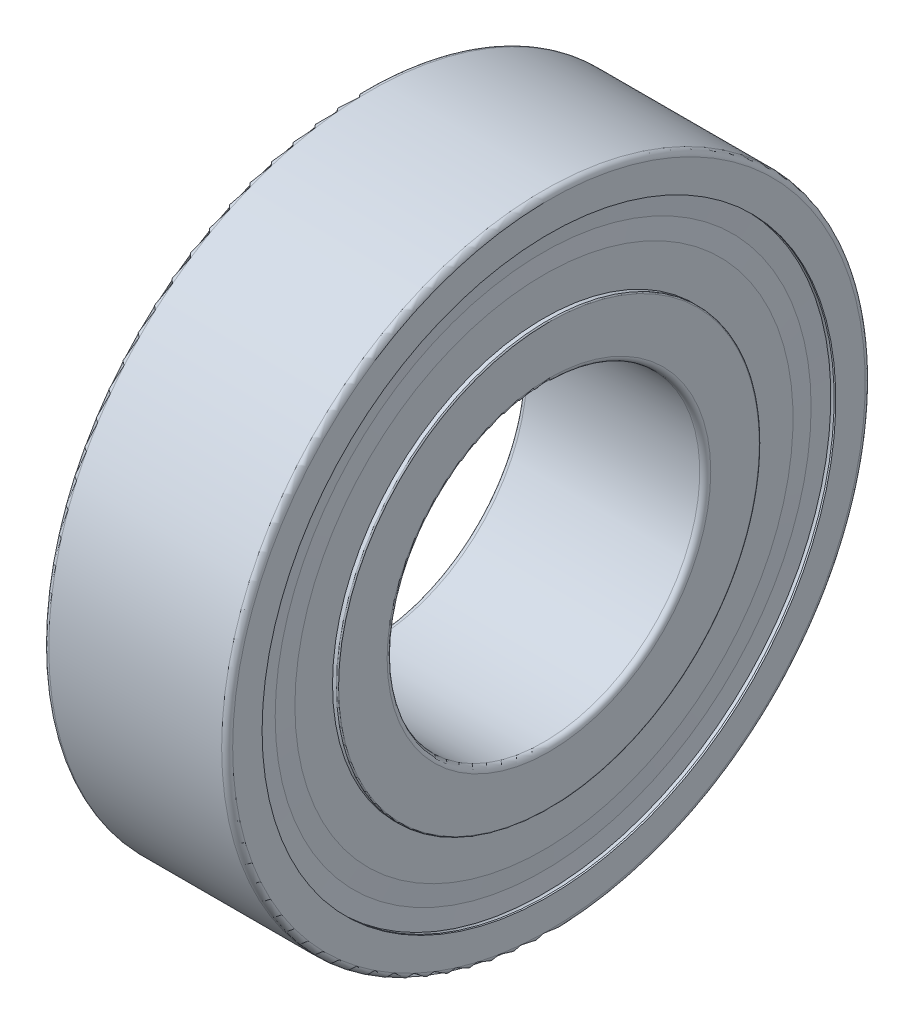
ISO-10303-21;
HEADER;
FILE_DESCRIPTION(('STEP AP214'),'2;1');
FILE_NAME('part.step','',(''),(''),'','','');
FILE_SCHEMA(('AUTOMOTIVE_DESIGN { 1 0 10303 214 1 1 1 1 }'));
ENDSEC;
DATA;
#1=APPLICATION_CONTEXT('core data for automotive mechanical design processes');
#2=APPLICATION_PROTOCOL_DEFINITION('international standard','automotive_design',2000,#1);
#3=PRODUCT_CONTEXT('',#1,'mechanical');
#4=PRODUCT('Part','Part','',(#3));
#5=PRODUCT_RELATED_PRODUCT_CATEGORY('part','',(#4));
#6=PRODUCT_DEFINITION_FORMATION('','',#4);
#7=PRODUCT_DEFINITION_CONTEXT('part definition',#1,'design');
#8=PRODUCT_DEFINITION('design','',#6,#7);
#9=PRODUCT_DEFINITION_SHAPE('','',#8);
#10=(LENGTH_UNIT() NAMED_UNIT(*) SI_UNIT(.MILLI.,.METRE.));
#11=(NAMED_UNIT(*) PLANE_ANGLE_UNIT() SI_UNIT($,.RADIAN.));
#12=(NAMED_UNIT(*) SI_UNIT($,.STERADIAN.) SOLID_ANGLE_UNIT());
#13=UNCERTAINTY_MEASURE_WITH_UNIT(LENGTH_MEASURE(1.E-05),#10,'distance_accuracy_value','');
#14=(GEOMETRIC_REPRESENTATION_CONTEXT(3) GLOBAL_UNCERTAINTY_ASSIGNED_CONTEXT((#13)) GLOBAL_UNIT_ASSIGNED_CONTEXT((#10,
#11,#12)) REPRESENTATION_CONTEXT('',''));
#15=CARTESIAN_POINT('',(0.,0.,0.));
#16=DIRECTION('',(0.,0.,1.));
#17=DIRECTION('',(1.,0.,0.));
#18=AXIS2_PLACEMENT_3D('',#15,#16,#17);
#19=CARTESIAN_POINT('',(50.,0.,0.));
#20=DIRECTION('',(1.,0.,0.));
#21=DIRECTION('',(0.,0.,1.));
#22=AXIS2_PLACEMENT_3D('',#19,#20,#21);
#23=CYLINDRICAL_SURFACE('',#22,15.6);
#24=CARTESIAN_POINT('',(9.73,0.,0.));
#25=DIRECTION('',(-1.,0.,0.));
#26=DIRECTION('',(0.,0.,1.));
#27=AXIS2_PLACEMENT_3D('',#24,#25,#26);
#28=CIRCLE('',#27,15.6);
#29=CARTESIAN_POINT('',(9.73,0.,15.6));
#30=VERTEX_POINT('',#29);
#31=EDGE_CURVE('E12',#30,#30,#28,.T.);
#32=ORIENTED_EDGE('',*,*,#31,.T.);
#33=EDGE_LOOP('',(#32));
#34=FACE_BOUND('',#33,.T.);
#35=CARTESIAN_POINT('',(9.64,0.,0.));
#36=DIRECTION('',(-1.,0.,0.));
#37=DIRECTION('',(0.,0.,1.));
#38=AXIS2_PLACEMENT_3D('',#35,#36,#37);
#39=CIRCLE('',#38,15.6);
#40=CARTESIAN_POINT('',(9.64,0.,15.6));
#41=VERTEX_POINT('',#40);
#42=EDGE_CURVE('E166',#41,#41,#39,.T.);
#43=ORIENTED_EDGE('',*,*,#42,.F.);
#44=EDGE_LOOP('',(#43));
#45=FACE_BOUND('',#44,.T.);
#46=ADVANCED_FACE('F53',(#34,#45),#23,.T.);
#47=CARTESIAN_POINT('',(9.685,0.,0.));
#48=DIRECTION('',(1.,0.,0.));
#49=DIRECTION('',(0.,0.,1.));
#50=AXIS2_PLACEMENT_3D('',#47,#48,#49);
#51=CONICAL_SURFACE('',#50,14.5725,1.52702867499964);
#52=CARTESIAN_POINT('',(9.685,0.,0.));
#53=DIRECTION('',(-1.,0.,0.));
#54=DIRECTION('',(0.,0.,1.));
#55=AXIS2_PLACEMENT_3D('',#52,#53,#54);
#56=CIRCLE('',#55,14.5725);
#57=CARTESIAN_POINT('',(9.685,0.,14.5725));
#58=VERTEX_POINT('',#57);
#59=EDGE_CURVE('E62',#58,#58,#56,.T.);
#60=ORIENTED_EDGE('',*,*,#59,.T.);
#61=EDGE_LOOP('',(#60));
#62=FACE_BOUND('',#61,.T.);
#63=ORIENTED_EDGE('',*,*,#31,.F.);
#64=EDGE_LOOP('',(#63));
#65=FACE_BOUND('',#64,.T.);
#66=ADVANCED_FACE('F198',(#62,#65),#51,.F.);
#67=CARTESIAN_POINT('',(9.73,0.,0.));
#68=DIRECTION('',(-1.,0.,0.));
#69=DIRECTION('',(0.,0.,-1.));
#70=AXIS2_PLACEMENT_3D('',#67,#68,#69);
#71=CONICAL_SURFACE('',#70,13.545,1.52702867499964);
#72=CARTESIAN_POINT('',(9.73,0.,0.));
#73=DIRECTION('',(-1.,0.,0.));
#74=DIRECTION('',(0.,0.,1.));
#75=AXIS2_PLACEMENT_3D('',#72,#73,#74);
#76=CIRCLE('',#75,13.545);
#77=CARTESIAN_POINT('',(9.73,0.,13.545));
#78=VERTEX_POINT('',#77);
#79=EDGE_CURVE('E147',#78,#78,#76,.T.);
#80=ORIENTED_EDGE('',*,*,#79,.T.);
#81=EDGE_LOOP('',(#80));
#82=FACE_BOUND('',#81,.T.);
#83=ORIENTED_EDGE('',*,*,#59,.F.);
#84=EDGE_LOOP('',(#83));
#85=FACE_BOUND('',#84,.T.);
#86=ADVANCED_FACE('F185',(#82,#85),#71,.T.);
#87=CARTESIAN_POINT('',(9.73,11.49,0.));
#88=DIRECTION('',(1.,0.,0.));
#89=DIRECTION('',(0.,1.,0.));
#90=AXIS2_PLACEMENT_3D('',#87,#88,#89);
#91=PLANE('',#90);
#92=CARTESIAN_POINT('',(9.73,0.,0.));
#93=DIRECTION('',(1.,0.,0.));
#94=DIRECTION('',(0.,0.,1.));
#95=AXIS2_PLACEMENT_3D('',#92,#93,#94);
#96=CIRCLE('',#95,11.5);
#97=CARTESIAN_POINT('',(9.73,0.,11.5));
#98=VERTEX_POINT('',#97);
#99=EDGE_CURVE('E151',#98,#98,#96,.T.);
#100=ORIENTED_EDGE('',*,*,#99,.F.);
#101=EDGE_LOOP('',(#100));
#102=FACE_BOUND('',#101,.T.);
#103=ORIENTED_EDGE('',*,*,#79,.F.);
#104=EDGE_LOOP('',(#103));
#105=FACE_BOUND('',#104,.T.);
#106=ADVANCED_FACE('F188',(#102,#105),#91,.T.);
#107=CARTESIAN_POINT('',(9.55,0.,0.));
#108=DIRECTION('',(-1.,0.,0.));
#109=DIRECTION('',(0.,0.,-1.));
#110=AXIS2_PLACEMENT_3D('',#107,#108,#109);
#111=CONICAL_SURFACE('',#110,13.545,1.52702867499964);
#112=CARTESIAN_POINT('',(9.55,0.,0.));
#113=DIRECTION('',(-1.,0.,0.));
#114=DIRECTION('',(0.,0.,1.));
#115=AXIS2_PLACEMENT_3D('',#112,#113,#114);
#116=CIRCLE('',#115,13.545);
#117=CARTESIAN_POINT('',(9.55,0.,13.545));
#118=VERTEX_POINT('',#117);
#119=EDGE_CURVE('E168',#118,#118,#116,.T.);
#120=ORIENTED_EDGE('',*,*,#119,.T.);
#121=EDGE_LOOP('',(#120));
#122=FACE_BOUND('',#121,.T.);
#123=CARTESIAN_POINT('',(9.63956204379562,0.,0.));
#124=DIRECTION('',(-1.,0.,0.));
#125=DIRECTION('',(0.,0.,-1.));
#126=AXIS2_PLACEMENT_3D('',#123,#124,#125);
#127=CIRCLE('',#126,11.5);
#128=CARTESIAN_POINT('',(9.63956204379562,0.,-11.5));
#129=VERTEX_POINT('',#128);
#130=EDGE_CURVE('E134',#129,#129,#127,.T.);
#131=ORIENTED_EDGE('',*,*,#130,.F.);
#132=EDGE_LOOP('',(#131));
#133=FACE_BOUND('',#132,.T.);
#134=ADVANCED_FACE('F55',(#122,#133),#111,.F.);
#135=CARTESIAN_POINT('',(9.55,14.5725,0.));
#136=DIRECTION('',(-1.,0.,0.));
#137=DIRECTION('',(0.,0.,-1.));
#138=AXIS2_PLACEMENT_3D('',#135,#136,#137);
#139=PLANE('',#138);
#140=CARTESIAN_POINT('',(9.55,0.,0.));
#141=DIRECTION('',(-1.,0.,0.));
#142=DIRECTION('',(0.,0.,1.));
#143=AXIS2_PLACEMENT_3D('',#140,#141,#142);
#144=CIRCLE('',#143,14.5725);
#145=CARTESIAN_POINT('',(9.55,0.,14.5725));
#146=VERTEX_POINT('',#145);
#147=EDGE_CURVE('E165',#146,#146,#144,.T.);
#148=ORIENTED_EDGE('',*,*,#147,.T.);
#149=EDGE_LOOP('',(#148));
#150=FACE_BOUND('',#149,.T.);
#151=ORIENTED_EDGE('',*,*,#119,.F.);
#152=EDGE_LOOP('',(#151));
#153=FACE_BOUND('',#152,.T.);
#154=ADVANCED_FACE('F196',(#150,#153),#139,.T.);
#155=CARTESIAN_POINT('',(9.64,0.,0.));
#156=DIRECTION('',(1.,0.,0.));
#157=DIRECTION('',(0.,0.,1.));
#158=AXIS2_PLACEMENT_3D('',#155,#156,#157);
#159=CONICAL_SURFACE('',#158,15.6,1.48342806694239);
#160=ORIENTED_EDGE('',*,*,#42,.T.);
#161=EDGE_LOOP('',(#160));
#162=FACE_BOUND('',#161,.T.);
#163=ORIENTED_EDGE('',*,*,#147,.F.);
#164=EDGE_LOOP('',(#163));
#165=FACE_BOUND('',#164,.T.);
#166=ADVANCED_FACE('F216',(#162,#165),#159,.T.);
#167=CARTESIAN_POINT('',(0.45,0.,0.));
#168=DIRECTION('',(-1.,0.,0.));
#169=DIRECTION('',(0.,0.,-1.));
#170=AXIS2_PLACEMENT_3D('',#167,#168,#169);
#171=CONICAL_SURFACE('',#170,14.5725,1.48342806694239);
#172=CARTESIAN_POINT('',(0.45,0.,0.));
#173=DIRECTION('',(-1.,0.,0.));
#174=DIRECTION('',(0.,0.,1.));
#175=AXIS2_PLACEMENT_3D('',#172,#173,#174);
#176=CIRCLE('',#175,14.5725);
#177=CARTESIAN_POINT('',(0.45,0.,14.5725));
#178=VERTEX_POINT('',#177);
#179=EDGE_CURVE('E163',#178,#178,#176,.T.);
#180=ORIENTED_EDGE('',*,*,#179,.T.);
#181=EDGE_LOOP('',(#180));
#182=FACE_BOUND('',#181,.T.);
#183=CARTESIAN_POINT('',(0.36,0.,0.));
#184=DIRECTION('',(-1.,0.,0.));
#185=DIRECTION('',(0.,0.,1.));
#186=AXIS2_PLACEMENT_3D('',#183,#184,#185);
#187=CIRCLE('',#186,15.6);
#188=CARTESIAN_POINT('',(0.36,0.,15.6));
#189=VERTEX_POINT('',#188);
#190=EDGE_CURVE('E145',#189,#189,#187,.T.);
#191=ORIENTED_EDGE('',*,*,#190,.F.);
#192=EDGE_LOOP('',(#191));
#193=FACE_BOUND('',#192,.T.);
#194=ADVANCED_FACE('F305',(#182,#193),#171,.T.);
#195=CARTESIAN_POINT('',(0.45,13.545,0.));
#196=DIRECTION('',(1.,0.,0.));
#197=DIRECTION('',(0.,1.,0.));
#198=AXIS2_PLACEMENT_3D('',#195,#196,#197);
#199=PLANE('',#198);
#200=CARTESIAN_POINT('',(0.45,0.,0.));
#201=DIRECTION('',(-1.,0.,0.));
#202=DIRECTION('',(0.,0.,1.));
#203=AXIS2_PLACEMENT_3D('',#200,#201,#202);
#204=CIRCLE('',#203,13.545);
#205=CARTESIAN_POINT('',(0.45,0.,13.545));
#206=VERTEX_POINT('',#205);
#207=EDGE_CURVE('E157',#206,#206,#204,.T.);
#208=ORIENTED_EDGE('',*,*,#207,.T.);
#209=EDGE_LOOP('',(#208));
#210=FACE_BOUND('',#209,.T.);
#211=ORIENTED_EDGE('',*,*,#179,.F.);
#212=EDGE_LOOP('',(#211));
#213=FACE_BOUND('',#212,.T.);
#214=ADVANCED_FACE('F212',(#210,#213),#199,.T.);
#215=CARTESIAN_POINT('',(0.36,0.,0.));
#216=DIRECTION('',(1.,0.,0.));
#217=DIRECTION('',(0.,0.,1.));
#218=AXIS2_PLACEMENT_3D('',#215,#216,#217);
#219=CONICAL_SURFACE('',#218,11.49,1.52702867499964);
#220=CARTESIAN_POINT('',(0.360437956204379,0.,0.));
#221=DIRECTION('',(1.,0.,0.));
#222=DIRECTION('',(0.,0.,1.));
#223=AXIS2_PLACEMENT_3D('',#220,#221,#222);
#224=CIRCLE('',#223,11.5);
#225=CARTESIAN_POINT('',(0.360437956204379,0.,11.5));
#226=VERTEX_POINT('',#225);
#227=EDGE_CURVE('E150',#226,#226,#224,.T.);
#228=ORIENTED_EDGE('',*,*,#227,.F.);
#229=EDGE_LOOP('',(#228));
#230=FACE_BOUND('',#229,.T.);
#231=ORIENTED_EDGE('',*,*,#207,.F.);
#232=EDGE_LOOP('',(#231));
#233=FACE_BOUND('',#232,.T.);
#234=ADVANCED_FACE('F238',(#230,#233),#219,.F.);
#235=CARTESIAN_POINT('',(0.27,13.545,0.));
#236=DIRECTION('',(-1.,0.,0.));
#237=DIRECTION('',(0.,0.,-1.));
#238=AXIS2_PLACEMENT_3D('',#235,#236,#237);
#239=PLANE('',#238);
#240=CARTESIAN_POINT('',(0.27,0.,0.));
#241=DIRECTION('',(-1.,0.,0.));
#242=DIRECTION('',(0.,0.,1.));
#243=AXIS2_PLACEMENT_3D('',#240,#241,#242);
#244=CIRCLE('',#243,13.545);
#245=CARTESIAN_POINT('',(0.27,0.,13.545));
#246=VERTEX_POINT('',#245);
#247=EDGE_CURVE('E144',#246,#246,#244,.T.);
#248=ORIENTED_EDGE('',*,*,#247,.T.);
#249=EDGE_LOOP('',(#248));
#250=FACE_BOUND('',#249,.T.);
#251=CARTESIAN_POINT('',(0.27,0.,0.));
#252=DIRECTION('',(-1.,0.,0.));
#253=DIRECTION('',(0.,0.,-1.));
#254=AXIS2_PLACEMENT_3D('',#251,#252,#253);
#255=CIRCLE('',#254,11.5);
#256=CARTESIAN_POINT('',(0.27,0.,-11.5));
#257=VERTEX_POINT('',#256);
#258=EDGE_CURVE('E152',#257,#257,#255,.T.);
#259=ORIENTED_EDGE('',*,*,#258,.F.);
#260=EDGE_LOOP('',(#259));
#261=FACE_BOUND('',#260,.T.);
#262=ADVANCED_FACE('F222',(#250,#261),#239,.T.);
#263=CARTESIAN_POINT('',(0.315,0.,0.));
#264=DIRECTION('',(1.,0.,0.));
#265=DIRECTION('',(0.,0.,1.));
#266=AXIS2_PLACEMENT_3D('',#263,#264,#265);
#267=CONICAL_SURFACE('',#266,14.5725,1.52702867499964);
#268=CARTESIAN_POINT('',(0.315,0.,0.));
#269=DIRECTION('',(-1.,0.,0.));
#270=DIRECTION('',(0.,0.,1.));
#271=AXIS2_PLACEMENT_3D('',#268,#269,#270);
#272=CIRCLE('',#271,14.5725);
#273=CARTESIAN_POINT('',(0.315,0.,14.5725));
#274=VERTEX_POINT('',#273);
#275=EDGE_CURVE('E142',#274,#274,#272,.T.);
#276=ORIENTED_EDGE('',*,*,#275,.T.);
#277=EDGE_LOOP('',(#276));
#278=FACE_BOUND('',#277,.T.);
#279=ORIENTED_EDGE('',*,*,#247,.F.);
#280=EDGE_LOOP('',(#279));
#281=FACE_BOUND('',#280,.T.);
#282=ADVANCED_FACE('F218',(#278,#281),#267,.T.);
#283=CARTESIAN_POINT('',(0.27,0.,0.));
#284=DIRECTION('',(-1.,0.,0.));
#285=DIRECTION('',(0.,0.,-1.));
#286=AXIS2_PLACEMENT_3D('',#283,#284,#285);
#287=CONICAL_SURFACE('',#286,15.6,1.52702867499964);
#288=CARTESIAN_POINT('',(0.27,0.,0.));
#289=DIRECTION('',(-1.,0.,0.));
#290=DIRECTION('',(0.,0.,1.));
#291=AXIS2_PLACEMENT_3D('',#288,#289,#290);
#292=CIRCLE('',#291,15.6);
#293=CARTESIAN_POINT('',(0.27,0.,15.6));
#294=VERTEX_POINT('',#293);
#295=EDGE_CURVE('E177',#294,#294,#292,.T.);
#296=ORIENTED_EDGE('',*,*,#295,.T.);
#297=EDGE_LOOP('',(#296));
#298=FACE_BOUND('',#297,.T.);
#299=ORIENTED_EDGE('',*,*,#275,.F.);
#300=EDGE_LOOP('',(#299));
#301=FACE_BOUND('',#300,.T.);
#302=ADVANCED_FACE('F221',(#298,#301),#287,.F.);
#303=CARTESIAN_POINT('',(50.,0.,0.));
#304=DIRECTION('',(1.,0.,0.));
#305=DIRECTION('',(0.,0.,1.));
#306=AXIS2_PLACEMENT_3D('',#303,#304,#305);
#307=CYLINDRICAL_SURFACE('',#306,15.6);
#308=ORIENTED_EDGE('',*,*,#190,.T.);
#309=EDGE_LOOP('',(#308));
#310=FACE_BOUND('',#309,.T.);
#311=ORIENTED_EDGE('',*,*,#295,.F.);
#312=EDGE_LOOP('',(#311));
#313=FACE_BOUND('',#312,.T.);
#314=ADVANCED_FACE('F271',(#310,#313),#307,.T.);
#315=CARTESIAN_POINT('',(50.,0.,0.));
#316=DIRECTION('',(1.,0.,0.));
#317=DIRECTION('',(0.,0.,1.));
#318=AXIS2_PLACEMENT_3D('',#315,#316,#317);
#319=CYLINDRICAL_SURFACE('',#318,11.5);
#320=CARTESIAN_POINT('',(3.15090265264373,0.,0.));
#321=DIRECTION('',(-1.,0.,0.));
#322=DIRECTION('',(0.,0.,1.));
#323=AXIS2_PLACEMENT_3D('',#320,#321,#322);
#324=CIRCLE('',#323,11.5);
#325=CARTESIAN_POINT('',(3.15090265264373,0.,11.5));
#326=VERTEX_POINT('',#325);
#327=EDGE_CURVE('E148',#326,#326,#324,.T.);
#328=ORIENTED_EDGE('',*,*,#327,.T.);
#329=EDGE_LOOP('',(#328));
#330=FACE_BOUND('',#329,.T.);
#331=ORIENTED_EDGE('',*,*,#227,.T.);
#332=EDGE_LOOP('',(#331));
#333=FACE_BOUND('',#332,.T.);
#334=ADVANCED_FACE('F273',(#330,#333),#319,.T.);
#335=CARTESIAN_POINT('',(5.,0.,0.));
#336=DIRECTION('',(1.,0.,0.));
#337=DIRECTION('',(0.,0.,1.));
#338=AXIS2_PLACEMENT_3D('',#335,#336,#337);
#339=TOROIDAL_SURFACE('',#338,13.,2.381);
#340=ORIENTED_EDGE('',*,*,#327,.F.);
#341=EDGE_LOOP('',(#340));
#342=FACE_BOUND('',#341,.T.);
#343=CARTESIAN_POINT('',(6.84909734735627,0.,0.));
#344=DIRECTION('',(-1.,0.,0.));
#345=DIRECTION('',(0.,0.,1.));
#346=AXIS2_PLACEMENT_3D('',#343,#344,#345);
#347=CIRCLE('',#346,11.5);
#348=CARTESIAN_POINT('',(6.84909734735627,0.,11.5));
#349=VERTEX_POINT('',#348);
#350=EDGE_CURVE('E131',#349,#349,#347,.T.);
#351=ORIENTED_EDGE('',*,*,#350,.T.);
#352=EDGE_LOOP('',(#351));
#353=FACE_BOUND('',#352,.T.);
#354=ADVANCED_FACE('F132',(#342,#353),#339,.F.);
#355=CARTESIAN_POINT('',(50.,0.,0.));
#356=DIRECTION('',(1.,0.,0.));
#357=DIRECTION('',(0.,0.,1.));
#358=AXIS2_PLACEMENT_3D('',#355,#356,#357);
#359=CYLINDRICAL_SURFACE('',#358,11.5);
#360=CARTESIAN_POINT('',(9.94,0.,0.));
#361=DIRECTION('',(-1.,0.,0.));
#362=DIRECTION('',(0.,0.,1.));
#363=AXIS2_PLACEMENT_3D('',#360,#361,#362);
#364=CIRCLE('',#363,11.5);
#365=CARTESIAN_POINT('',(9.94,0.,11.5));
#366=VERTEX_POINT('',#365);
#367=EDGE_CURVE('E171',#366,#366,#364,.T.);
#368=ORIENTED_EDGE('',*,*,#367,.T.);
#369=EDGE_LOOP('',(#368));
#370=FACE_BOUND('',#369,.T.);
#371=ORIENTED_EDGE('',*,*,#99,.T.);
#372=EDGE_LOOP('',(#371));
#373=FACE_BOUND('',#372,.T.);
#374=ADVANCED_FACE('F234',(#370,#373),#359,.T.);
#375=CARTESIAN_POINT('',(9.94,0.,0.));
#376=DIRECTION('',(1.,0.,0.));
#377=DIRECTION('',(0.,0.,1.));
#378=AXIS2_PLACEMENT_3D('',#375,#376,#377);
#379=TOROIDAL_SURFACE('',#378,11.44,0.0599999999999976);
#380=CARTESIAN_POINT('',(10.,0.,0.));
#381=DIRECTION('',(-1.,0.,0.));
#382=DIRECTION('',(0.,0.,1.));
#383=AXIS2_PLACEMENT_3D('',#380,#381,#382);
#384=CIRCLE('',#383,11.44);
#385=CARTESIAN_POINT('',(10.,0.,11.44));
#386=VERTEX_POINT('',#385);
#387=EDGE_CURVE('E161',#386,#386,#384,.T.);
#388=ORIENTED_EDGE('',*,*,#387,.T.);
#389=EDGE_LOOP('',(#388));
#390=FACE_BOUND('',#389,.T.);
#391=ORIENTED_EDGE('',*,*,#367,.F.);
#392=EDGE_LOOP('',(#391));
#393=FACE_BOUND('',#392,.T.);
#394=ADVANCED_FACE('F230',(#390,#393),#379,.T.);
#395=CARTESIAN_POINT('',(10.,8.8,0.));
#396=DIRECTION('',(1.,0.,0.));
#397=DIRECTION('',(0.,1.,0.));
#398=AXIS2_PLACEMENT_3D('',#395,#396,#397);
#399=PLANE('',#398);
#400=CARTESIAN_POINT('',(10.,0.,0.));
#401=DIRECTION('',(-1.,0.,0.));
#402=DIRECTION('',(0.,0.,1.));
#403=AXIS2_PLACEMENT_3D('',#400,#401,#402);
#404=CIRCLE('',#403,8.8);
#405=CARTESIAN_POINT('',(10.,0.,8.8));
#406=VERTEX_POINT('',#405);
#407=EDGE_CURVE('E158',#406,#406,#404,.T.);
#408=ORIENTED_EDGE('',*,*,#407,.T.);
#409=EDGE_LOOP('',(#408));
#410=FACE_BOUND('',#409,.T.);
#411=ORIENTED_EDGE('',*,*,#387,.F.);
#412=EDGE_LOOP('',(#411));
#413=FACE_BOUND('',#412,.T.);
#414=ADVANCED_FACE('F233',(#410,#413),#399,.T.);
#415=CARTESIAN_POINT('',(9.7,0.,0.));
#416=DIRECTION('',(1.,0.,0.));
#417=DIRECTION('',(0.,0.,1.));
#418=AXIS2_PLACEMENT_3D('',#415,#416,#417);
#419=TOROIDAL_SURFACE('',#418,8.8,0.300000000000005);
#420=CARTESIAN_POINT('',(9.7,0.,0.));
#421=DIRECTION('',(-1.,0.,0.));
#422=DIRECTION('',(0.,0.,1.));
#423=AXIS2_PLACEMENT_3D('',#420,#421,#422);
#424=CIRCLE('',#423,8.5);
#425=CARTESIAN_POINT('',(9.7,0.,8.5));
#426=VERTEX_POINT('',#425);
#427=EDGE_CURVE('E162',#426,#426,#424,.T.);
#428=ORIENTED_EDGE('',*,*,#427,.T.);
#429=EDGE_LOOP('',(#428));
#430=FACE_BOUND('',#429,.T.);
#431=ORIENTED_EDGE('',*,*,#407,.F.);
#432=EDGE_LOOP('',(#431));
#433=FACE_BOUND('',#432,.T.);
#434=ADVANCED_FACE('F228',(#430,#433),#419,.T.);
#435=CARTESIAN_POINT('',(50.,0.,0.));
#436=DIRECTION('',(1.,0.,0.));
#437=DIRECTION('',(0.,0.,1.));
#438=AXIS2_PLACEMENT_3D('',#435,#436,#437);
#439=CYLINDRICAL_SURFACE('',#438,8.5);
#440=CARTESIAN_POINT('',(0.3,0.,0.));
#441=DIRECTION('',(-1.,0.,0.));
#442=DIRECTION('',(0.,0.,1.));
#443=AXIS2_PLACEMENT_3D('',#440,#441,#442);
#444=CIRCLE('',#443,8.5);
#445=CARTESIAN_POINT('',(0.3,0.,8.5));
#446=VERTEX_POINT('',#445);
#447=EDGE_CURVE('E176',#446,#446,#444,.T.);
#448=ORIENTED_EDGE('',*,*,#447,.T.);
#449=EDGE_LOOP('',(#448));
#450=FACE_BOUND('',#449,.T.);
#451=ORIENTED_EDGE('',*,*,#427,.F.);
#452=EDGE_LOOP('',(#451));
#453=FACE_BOUND('',#452,.T.);
#454=ADVANCED_FACE('F224',(#450,#453),#439,.F.);
#455=CARTESIAN_POINT('',(0.3,0.,0.));
#456=DIRECTION('',(1.,0.,0.));
#457=DIRECTION('',(0.,0.,1.));
#458=AXIS2_PLACEMENT_3D('',#455,#456,#457);
#459=TOROIDAL_SURFACE('',#458,8.8,0.3);
#460=CARTESIAN_POINT('',(0.,0.,0.));
#461=DIRECTION('',(-1.,0.,0.));
#462=DIRECTION('',(0.,0.,1.));
#463=AXIS2_PLACEMENT_3D('',#460,#461,#462);
#464=CIRCLE('',#463,8.8);
#465=CARTESIAN_POINT('',(0.,0.,8.8));
#466=VERTEX_POINT('',#465);
#467=EDGE_CURVE('E181',#466,#466,#464,.T.);
#468=ORIENTED_EDGE('',*,*,#467,.T.);
#469=EDGE_LOOP('',(#468));
#470=FACE_BOUND('',#469,.T.);
#471=ORIENTED_EDGE('',*,*,#447,.F.);
#472=EDGE_LOOP('',(#471));
#473=FACE_BOUND('',#472,.T.);
#474=ADVANCED_FACE('F227',(#470,#473),#459,.T.);
#475=CARTESIAN_POINT('',(0.,11.44,0.));
#476=DIRECTION('',(-1.,0.,0.));
#477=DIRECTION('',(0.,0.,-1.));
#478=AXIS2_PLACEMENT_3D('',#475,#476,#477);
#479=PLANE('',#478);
#480=CARTESIAN_POINT('',(0.,0.,0.));
#481=DIRECTION('',(-1.,0.,0.));
#482=DIRECTION('',(0.,0.,1.));
#483=AXIS2_PLACEMENT_3D('',#480,#481,#482);
#484=CIRCLE('',#483,11.44);
#485=CARTESIAN_POINT('',(0.,0.,11.44));
#486=VERTEX_POINT('',#485);
#487=EDGE_CURVE('E140',#486,#486,#484,.T.);
#488=ORIENTED_EDGE('',*,*,#487,.T.);
#489=EDGE_LOOP('',(#488));
#490=FACE_BOUND('',#489,.T.);
#491=ORIENTED_EDGE('',*,*,#467,.F.);
#492=EDGE_LOOP('',(#491));
#493=FACE_BOUND('',#492,.T.);
#494=ADVANCED_FACE('F242',(#490,#493),#479,.T.);
#495=CARTESIAN_POINT('',(0.0599999999999987,0.,0.));
#496=DIRECTION('',(1.,0.,0.));
#497=DIRECTION('',(0.,0.,1.));
#498=AXIS2_PLACEMENT_3D('',#495,#496,#497);
#499=TOROIDAL_SURFACE('',#498,11.44,0.0599999999999993);
#500=CARTESIAN_POINT('',(0.0599999999999976,0.,0.));
#501=DIRECTION('',(-1.,0.,0.));
#502=DIRECTION('',(0.,0.,1.));
#503=AXIS2_PLACEMENT_3D('',#500,#501,#502);
#504=CIRCLE('',#503,11.5);
#505=CARTESIAN_POINT('',(0.0599999999999976,0.,11.5));
#506=VERTEX_POINT('',#505);
#507=EDGE_CURVE('E136',#506,#506,#504,.T.);
#508=ORIENTED_EDGE('',*,*,#507,.T.);
#509=EDGE_LOOP('',(#508));
#510=FACE_BOUND('',#509,.T.);
#511=ORIENTED_EDGE('',*,*,#487,.F.);
#512=EDGE_LOOP('',(#511));
#513=FACE_BOUND('',#512,.T.);
#514=ADVANCED_FACE('F298',(#510,#513),#499,.T.);
#515=CARTESIAN_POINT('',(50.,0.,0.));
#516=DIRECTION('',(1.,0.,0.));
#517=DIRECTION('',(0.,0.,1.));
#518=AXIS2_PLACEMENT_3D('',#515,#516,#517);
#519=CYLINDRICAL_SURFACE('',#518,11.5);
#520=ORIENTED_EDGE('',*,*,#258,.T.);
#521=EDGE_LOOP('',(#520));
#522=FACE_BOUND('',#521,.T.);
#523=ORIENTED_EDGE('',*,*,#507,.F.);
#524=EDGE_LOOP('',(#523));
#525=FACE_BOUND('',#524,.T.);
#526=ADVANCED_FACE('F295',(#522,#525),#519,.T.);
#527=CARTESIAN_POINT('',(50.,0.,0.));
#528=DIRECTION('',(1.,0.,0.));
#529=DIRECTION('',(0.,0.,1.));
#530=AXIS2_PLACEMENT_3D('',#527,#528,#529);
#531=CYLINDRICAL_SURFACE('',#530,11.5);
#532=ORIENTED_EDGE('',*,*,#130,.T.);
#533=EDGE_LOOP('',(#532));
#534=FACE_BOUND('',#533,.T.);
#535=ORIENTED_EDGE('',*,*,#350,.F.);
#536=EDGE_LOOP('',(#535));
#537=FACE_BOUND('',#536,.T.);
#538=ADVANCED_FACE('F297',(#534,#537),#531,.T.);
#539=CLOSED_SHELL('',(#46,#66,#86,#106,#134,#154,#166,#194,#214,#234,#262,#282,#302,#314,#334,
#354,#374,#394,#414,#434,#454,#474,#494,#514,#526,#538));
#540=MANIFOLD_SOLID_BREP('B2',#539);
#541=CARTESIAN_POINT('',(50.,0.,0.));
#542=DIRECTION('',(1.,0.,0.));
#543=DIRECTION('',(0.,0.,1.));
#544=AXIS2_PLACEMENT_3D('',#541,#542,#543);
#545=CYLINDRICAL_SURFACE('',#544,17.5);
#546=CARTESIAN_POINT('',(9.7,0.,0.));
#547=DIRECTION('',(-1.,0.,0.));
#548=DIRECTION('',(0.,0.,1.));
#549=AXIS2_PLACEMENT_3D('',#546,#547,#548);
#550=CIRCLE('',#549,17.5);
#551=CARTESIAN_POINT('',(9.7,0.,17.5));
#552=VERTEX_POINT('',#551);
#553=EDGE_CURVE('E51',#552,#552,#550,.T.);
#554=ORIENTED_EDGE('',*,*,#553,.T.);
#555=EDGE_LOOP('',(#554));
#556=FACE_BOUND('',#555,.T.);
#557=CARTESIAN_POINT('',(0.3,0.,0.));
#558=DIRECTION('',(-1.,0.,0.));
#559=DIRECTION('',(0.,0.,1.));
#560=AXIS2_PLACEMENT_3D('',#557,#558,#559);
#561=CIRCLE('',#560,17.5);
#562=CARTESIAN_POINT('',(0.3,0.,17.5));
#563=VERTEX_POINT('',#562);
#564=EDGE_CURVE('E566',#563,#563,#561,.T.);
#565=ORIENTED_EDGE('',*,*,#564,.F.);
#566=EDGE_LOOP('',(#565));
#567=FACE_BOUND('',#566,.T.);
#568=ADVANCED_FACE('F504',(#556,#567),#545,.T.);
#569=CARTESIAN_POINT('',(9.7,0.,0.));
#570=DIRECTION('',(1.,0.,0.));
#571=DIRECTION('',(0.,0.,1.));
#572=AXIS2_PLACEMENT_3D('',#569,#570,#571);
#573=TOROIDAL_SURFACE('',#572,17.2,0.3);
#574=CARTESIAN_POINT('',(10.,0.,0.));
#575=DIRECTION('',(-1.,0.,0.));
#576=DIRECTION('',(0.,0.,1.));
#577=AXIS2_PLACEMENT_3D('',#574,#575,#576);
#578=CIRCLE('',#577,17.2);
#579=CARTESIAN_POINT('',(10.,0.,17.2));
#580=VERTEX_POINT('',#579);
#581=EDGE_CURVE('E514',#580,#580,#578,.T.);
#582=ORIENTED_EDGE('',*,*,#581,.T.);
#583=EDGE_LOOP('',(#582));
#584=FACE_BOUND('',#583,.T.);
#585=ORIENTED_EDGE('',*,*,#553,.F.);
#586=EDGE_LOOP('',(#585));
#587=FACE_BOUND('',#586,.T.);
#588=ADVANCED_FACE('F506',(#584,#587),#573,.T.);
#589=CARTESIAN_POINT('',(10.,15.6,0.));
#590=DIRECTION('',(1.,0.,0.));
#591=DIRECTION('',(0.,1.,0.));
#592=AXIS2_PLACEMENT_3D('',#589,#590,#591);
#593=PLANE('',#592);
#594=CARTESIAN_POINT('',(10.,0.,0.));
#595=DIRECTION('',(-1.,0.,0.));
#596=DIRECTION('',(0.,0.,1.));
#597=AXIS2_PLACEMENT_3D('',#594,#595,#596);
#598=CIRCLE('',#597,15.6);
#599=CARTESIAN_POINT('',(10.,0.,15.6));
#600=VERTEX_POINT('',#599);
#601=EDGE_CURVE('E555',#600,#600,#598,.T.);
#602=ORIENTED_EDGE('',*,*,#601,.T.);
#603=EDGE_LOOP('',(#602));
#604=FACE_BOUND('',#603,.T.);
#605=ORIENTED_EDGE('',*,*,#581,.F.);
#606=EDGE_LOOP('',(#605));
#607=FACE_BOUND('',#606,.T.);
#608=ADVANCED_FACE('F556',(#604,#607),#593,.T.);
#609=CARTESIAN_POINT('',(50.,0.,0.));
#610=DIRECTION('',(1.,0.,0.));
#611=DIRECTION('',(0.,0.,1.));
#612=AXIS2_PLACEMENT_3D('',#609,#610,#611);
#613=CYLINDRICAL_SURFACE('',#612,15.6);
#614=CARTESIAN_POINT('',(9.91,0.,0.));
#615=DIRECTION('',(-1.,0.,0.));
#616=DIRECTION('',(0.,0.,1.));
#617=AXIS2_PLACEMENT_3D('',#614,#615,#616);
#618=CIRCLE('',#617,15.6);
#619=CARTESIAN_POINT('',(9.91,0.,15.6));
#620=VERTEX_POINT('',#619);
#621=EDGE_CURVE('E559',#620,#620,#618,.T.);
#622=ORIENTED_EDGE('',*,*,#621,.T.);
#623=EDGE_LOOP('',(#622));
#624=FACE_BOUND('',#623,.T.);
#625=ORIENTED_EDGE('',*,*,#601,.F.);
#626=EDGE_LOOP('',(#625));
#627=FACE_BOUND('',#626,.T.);
#628=ADVANCED_FACE('F602',(#624,#627),#613,.F.);
#629=CARTESIAN_POINT('',(9.73,0.,0.));
#630=DIRECTION('',(1.,0.,0.));
#631=DIRECTION('',(0.,0.,1.));
#632=AXIS2_PLACEMENT_3D('',#629,#630,#631);
#633=TOROIDAL_SURFACE('',#632,15.6000000094977,0.18);
#634=ORIENTED_EDGE('',*,*,#621,.F.);
#635=EDGE_LOOP('',(#634));
#636=FACE_BOUND('',#635,.T.);
#637=CARTESIAN_POINT('',(9.55,0.,0.));
#638=DIRECTION('',(-1.,0.,0.));
#639=DIRECTION('',(0.,0.,1.));
#640=AXIS2_PLACEMENT_3D('',#637,#638,#639);
#641=CIRCLE('',#640,15.6);
#642=CARTESIAN_POINT('',(9.55,0.,15.6));
#643=VERTEX_POINT('',#642);
#644=EDGE_CURVE('E562',#643,#643,#641,.T.);
#645=ORIENTED_EDGE('',*,*,#644,.T.);
#646=EDGE_LOOP('',(#645));
#647=FACE_BOUND('',#646,.T.);
#648=ADVANCED_FACE('F598',(#636,#647),#633,.F.);
#649=CARTESIAN_POINT('',(9.37367301929154,0.,0.));
#650=DIRECTION('',(1.,0.,0.));
#651=DIRECTION('',(0.,0.,1.));
#652=AXIS2_PLACEMENT_3D('',#649,#650,#651);
#653=CONICAL_SURFACE('',#652,14.6,1.39626340159546);
#654=CARTESIAN_POINT('',(9.37367301929154,0.,0.));
#655=DIRECTION('',(-1.,0.,0.));
#656=DIRECTION('',(0.,0.,1.));
#657=AXIS2_PLACEMENT_3D('',#654,#655,#656);
#658=CIRCLE('',#657,14.6);
#659=CARTESIAN_POINT('',(9.37367301929154,0.,14.6));
#660=VERTEX_POINT('',#659);
#661=EDGE_CURVE('E508',#660,#660,#658,.T.);
#662=ORIENTED_EDGE('',*,*,#661,.T.);
#663=EDGE_LOOP('',(#662));
#664=FACE_BOUND('',#663,.T.);
#665=ORIENTED_EDGE('',*,*,#644,.F.);
#666=EDGE_LOOP('',(#665));
#667=FACE_BOUND('',#666,.T.);
#668=ADVANCED_FACE('F601',(#664,#667),#653,.F.);
#669=CARTESIAN_POINT('',(50.,0.,0.));
#670=DIRECTION('',(1.,0.,0.));
#671=DIRECTION('',(0.,0.,1.));
#672=AXIS2_PLACEMENT_3D('',#669,#670,#671);
#673=CYLINDRICAL_SURFACE('',#672,14.6);
#674=CARTESIAN_POINT('',(6.76328131618299,0.,0.));
#675=DIRECTION('',(-1.,0.,0.));
#676=DIRECTION('',(0.,0.,1.));
#677=AXIS2_PLACEMENT_3D('',#674,#675,#676);
#678=CIRCLE('',#677,14.6);
#679=CARTESIAN_POINT('',(6.76328131618299,0.,14.6));
#680=VERTEX_POINT('',#679);
#681=EDGE_CURVE('E579',#680,#680,#678,.T.);
#682=ORIENTED_EDGE('',*,*,#681,.T.);
#683=EDGE_LOOP('',(#682));
#684=FACE_BOUND('',#683,.T.);
#685=ORIENTED_EDGE('',*,*,#661,.F.);
#686=EDGE_LOOP('',(#685));
#687=FACE_BOUND('',#686,.T.);
#688=ADVANCED_FACE('F612',(#684,#687),#673,.F.);
#689=CARTESIAN_POINT('',(5.,0.,0.));
#690=DIRECTION('',(1.,0.,0.));
#691=DIRECTION('',(0.,0.,1.));
#692=AXIS2_PLACEMENT_3D('',#689,#690,#691);
#693=TOROIDAL_SURFACE('',#692,13.,2.381);
#694=ORIENTED_EDGE('',*,*,#681,.F.);
#695=EDGE_LOOP('',(#694));
#696=FACE_BOUND('',#695,.T.);
#697=CARTESIAN_POINT('',(3.23671868381702,0.,0.));
#698=DIRECTION('',(-1.,0.,0.));
#699=DIRECTION('',(0.,0.,1.));
#700=AXIS2_PLACEMENT_3D('',#697,#698,#699);
#701=CIRCLE('',#700,14.6);
#702=CARTESIAN_POINT('',(3.23671868381702,0.,14.6));
#703=VERTEX_POINT('',#702);
#704=EDGE_CURVE('E577',#703,#703,#701,.T.);
#705=ORIENTED_EDGE('',*,*,#704,.T.);
#706=EDGE_LOOP('',(#705));
#707=FACE_BOUND('',#706,.T.);
#708=ADVANCED_FACE('F626',(#696,#707),#693,.F.);
#709=CARTESIAN_POINT('',(50.,0.,0.));
#710=DIRECTION('',(1.,0.,0.));
#711=DIRECTION('',(0.,0.,1.));
#712=AXIS2_PLACEMENT_3D('',#709,#710,#711);
#713=CYLINDRICAL_SURFACE('',#712,14.6);
#714=CARTESIAN_POINT('',(0.626326980708462,0.,0.));
#715=DIRECTION('',(-1.,0.,0.));
#716=DIRECTION('',(0.,0.,1.));
#717=AXIS2_PLACEMENT_3D('',#714,#715,#716);
#718=CIRCLE('',#717,14.6);
#719=CARTESIAN_POINT('',(0.626326980708462,0.,14.6));
#720=VERTEX_POINT('',#719);
#721=EDGE_CURVE('E574',#720,#720,#718,.T.);
#722=ORIENTED_EDGE('',*,*,#721,.T.);
#723=EDGE_LOOP('',(#722));
#724=FACE_BOUND('',#723,.T.);
#725=ORIENTED_EDGE('',*,*,#704,.F.);
#726=EDGE_LOOP('',(#725));
#727=FACE_BOUND('',#726,.T.);
#728=ADVANCED_FACE('F623',(#724,#727),#713,.F.);
#729=CARTESIAN_POINT('',(0.45,0.,0.));
#730=DIRECTION('',(-1.,0.,0.));
#731=DIRECTION('',(0.,0.,-1.));
#732=AXIS2_PLACEMENT_3D('',#729,#730,#731);
#733=CONICAL_SURFACE('',#732,15.6,1.39626340159546);
#734=CARTESIAN_POINT('',(0.45,0.,0.));
#735=DIRECTION('',(-1.,0.,0.));
#736=DIRECTION('',(0.,0.,1.));
#737=AXIS2_PLACEMENT_3D('',#734,#735,#736);
#738=CIRCLE('',#737,15.6);
#739=CARTESIAN_POINT('',(0.45,0.,15.6));
#740=VERTEX_POINT('',#739);
#741=EDGE_CURVE('E572',#740,#740,#738,.T.);
#742=ORIENTED_EDGE('',*,*,#741,.T.);
#743=EDGE_LOOP('',(#742));
#744=FACE_BOUND('',#743,.T.);
#745=ORIENTED_EDGE('',*,*,#721,.F.);
#746=EDGE_LOOP('',(#745));
#747=FACE_BOUND('',#746,.T.);
#748=ADVANCED_FACE('F616',(#744,#747),#733,.F.);
#749=CARTESIAN_POINT('',(0.27,0.,0.));
#750=DIRECTION('',(1.,0.,0.));
#751=DIRECTION('',(0.,0.,1.));
#752=AXIS2_PLACEMENT_3D('',#749,#750,#751);
#753=TOROIDAL_SURFACE('',#752,15.6,0.18);
#754=ORIENTED_EDGE('',*,*,#741,.F.);
#755=EDGE_LOOP('',(#754));
#756=FACE_BOUND('',#755,.T.);
#757=CARTESIAN_POINT('',(0.09,0.,0.));
#758=DIRECTION('',(-1.,0.,0.));
#759=DIRECTION('',(0.,0.,1.));
#760=AXIS2_PLACEMENT_3D('',#757,#758,#759);
#761=CIRCLE('',#760,15.6);
#762=CARTESIAN_POINT('',(0.09,0.,15.6));
#763=VERTEX_POINT('',#762);
#764=EDGE_CURVE('E569',#763,#763,#761,.T.);
#765=ORIENTED_EDGE('',*,*,#764,.T.);
#766=EDGE_LOOP('',(#765));
#767=FACE_BOUND('',#766,.T.);
#768=ADVANCED_FACE('F608',(#756,#767),#753,.F.);
#769=CARTESIAN_POINT('',(50.,0.,0.));
#770=DIRECTION('',(1.,0.,0.));
#771=DIRECTION('',(0.,0.,1.));
#772=AXIS2_PLACEMENT_3D('',#769,#770,#771);
#773=CYLINDRICAL_SURFACE('',#772,15.6);
#774=CARTESIAN_POINT('',(0.,0.,0.));
#775=DIRECTION('',(-1.,0.,0.));
#776=DIRECTION('',(0.,0.,1.));
#777=AXIS2_PLACEMENT_3D('',#774,#775,#776);
#778=CIRCLE('',#777,15.6);
#779=CARTESIAN_POINT('',(0.,0.,15.6));
#780=VERTEX_POINT('',#779);
#781=EDGE_CURVE('E568',#780,#780,#778,.T.);
#782=ORIENTED_EDGE('',*,*,#781,.T.);
#783=EDGE_LOOP('',(#782));
#784=FACE_BOUND('',#783,.T.);
#785=ORIENTED_EDGE('',*,*,#764,.F.);
#786=EDGE_LOOP('',(#785));
#787=FACE_BOUND('',#786,.T.);
#788=ADVANCED_FACE('F604',(#784,#787),#773,.F.);
#789=CARTESIAN_POINT('',(0.,17.2,0.));
#790=DIRECTION('',(-1.,0.,0.));
#791=DIRECTION('',(0.,0.,-1.));
#792=AXIS2_PLACEMENT_3D('',#789,#790,#791);
#793=PLANE('',#792);
#794=CARTESIAN_POINT('',(0.,0.,0.));
#795=DIRECTION('',(-1.,0.,0.));
#796=DIRECTION('',(0.,0.,1.));
#797=AXIS2_PLACEMENT_3D('',#794,#795,#796);
#798=CIRCLE('',#797,17.2);
#799=CARTESIAN_POINT('',(0.,0.,17.2));
#800=VERTEX_POINT('',#799);
#801=EDGE_CURVE('E581',#800,#800,#798,.T.);
#802=ORIENTED_EDGE('',*,*,#801,.T.);
#803=EDGE_LOOP('',(#802));
#804=FACE_BOUND('',#803,.T.);
#805=ORIENTED_EDGE('',*,*,#781,.F.);
#806=EDGE_LOOP('',(#805));
#807=FACE_BOUND('',#806,.T.);
#808=ADVANCED_FACE('F607',(#804,#807),#793,.T.);
#809=CARTESIAN_POINT('',(0.3,0.,0.));
#810=DIRECTION('',(1.,0.,0.));
#811=DIRECTION('',(0.,0.,1.));
#812=AXIS2_PLACEMENT_3D('',#809,#810,#811);
#813=TOROIDAL_SURFACE('',#812,17.2,0.3);
#814=ORIENTED_EDGE('',*,*,#564,.T.);
#815=EDGE_LOOP('',(#814));
#816=FACE_BOUND('',#815,.T.);
#817=ORIENTED_EDGE('',*,*,#801,.F.);
#818=EDGE_LOOP('',(#817));
#819=FACE_BOUND('',#818,.T.);
#820=ADVANCED_FACE('F586',(#816,#819),#813,.T.);
#821=CLOSED_SHELL('',(#568,#588,#608,#628,#648,#668,#688,#708,#728,#748,#768,#788,#808,#820));
#822=MANIFOLD_SOLID_BREP('B6',#821);
#823=CARTESIAN_POINT('',(5.,13.,0.));
#824=DIRECTION('',(1.,0.,0.));
#825=DIRECTION('',(0.,-1.,0.));
#826=AXIS2_PLACEMENT_3D('',#823,#824,#825);
#827=SPHERICAL_SURFACE('',#826,2.381);
#828=CARTESIAN_POINT('',(2.619,13.,0.));
#829=VERTEX_POINT('',#828);
#830=VERTEX_LOOP('',#829);
#831=FACE_BOUND('',#830,.T.);
#832=ADVANCED_FACE('F750',(#831),#827,.T.);
#833=CLOSED_SHELL('',(#832));
#834=MANIFOLD_SOLID_BREP('B45',#833);
#835=CARTESIAN_POINT('',(5.,10.5172209268743,7.64120827980215));
#836=DIRECTION('',(1.,0.,0.));
#837=DIRECTION('',(0.,-0.809016994374947,-0.587785252292473));
#838=AXIS2_PLACEMENT_3D('',#835,#836,#837);
#839=SPHERICAL_SURFACE('',#838,2.381);
#840=CARTESIAN_POINT('',(2.619,10.5172209268743,7.64120827980215));
#841=VERTEX_POINT('',#840);
#842=VERTEX_LOOP('',#841);
#843=FACE_BOUND('',#842,.T.);
#844=ADVANCED_FACE('F773',(#843),#839,.T.);
#845=CLOSED_SHELL('',(#844));
#846=MANIFOLD_SOLID_BREP('B498',#845);
#847=CARTESIAN_POINT('',(5.,4.01722092687432,12.363734711837));
#848=DIRECTION('',(1.,0.,0.));
#849=DIRECTION('',(0.,-0.309016994374948,-0.951056516295153));
#850=AXIS2_PLACEMENT_3D('',#847,#848,#849);
#851=SPHERICAL_SURFACE('',#850,2.381);
#852=CARTESIAN_POINT('',(2.619,4.01722092687432,12.363734711837));
#853=VERTEX_POINT('',#852);
#854=VERTEX_LOOP('',#853);
#855=FACE_BOUND('',#854,.T.);
#856=ADVANCED_FACE('F796',(#855),#851,.T.);
#857=CLOSED_SHELL('',(#856));
#858=MANIFOLD_SOLID_BREP('B744',#857);
#859=CARTESIAN_POINT('',(5.,-4.01722092687431,12.363734711837));
#860=DIRECTION('',(1.,0.,0.));
#861=DIRECTION('',(0.,0.309016994374947,-0.951056516295154));
#862=AXIS2_PLACEMENT_3D('',#859,#860,#861);
#863=SPHERICAL_SURFACE('',#862,2.381);
#864=CARTESIAN_POINT('',(2.619,-4.01722092687431,12.363734711837));
#865=VERTEX_POINT('',#864);
#866=VERTEX_LOOP('',#865);
#867=FACE_BOUND('',#866,.T.);
#868=ADVANCED_FACE('F819',(#867),#863,.T.);
#869=CLOSED_SHELL('',(#868));
#870=MANIFOLD_SOLID_BREP('B767',#869);
#871=CARTESIAN_POINT('',(5.,-10.5172209268743,7.64120827980215));
#872=DIRECTION('',(1.,0.,0.));
#873=DIRECTION('',(0.,0.809016994374947,-0.587785252292473));
#874=AXIS2_PLACEMENT_3D('',#871,#872,#873);
#875=SPHERICAL_SURFACE('',#874,2.381);
#876=CARTESIAN_POINT('',(2.619,-10.5172209268743,7.64120827980215));
#877=VERTEX_POINT('',#876);
#878=VERTEX_LOOP('',#877);
#879=FACE_BOUND('',#878,.T.);
#880=ADVANCED_FACE('F842',(#879),#875,.T.);
#881=CLOSED_SHELL('',(#880));
#882=MANIFOLD_SOLID_BREP('B790',#881);
#883=CARTESIAN_POINT('',(5.,-13.,0.));
#884=DIRECTION('',(1.,0.,0.));
#885=DIRECTION('',(0.,1.,0.));
#886=AXIS2_PLACEMENT_3D('',#883,#884,#885);
#887=SPHERICAL_SURFACE('',#886,2.381);
#888=CARTESIAN_POINT('',(2.619,-13.,0.));
#889=VERTEX_POINT('',#888);
#890=VERTEX_LOOP('',#889);
#891=FACE_BOUND('',#890,.T.);
#892=ADVANCED_FACE('F865',(#891),#887,.T.);
#893=CLOSED_SHELL('',(#892));
#894=MANIFOLD_SOLID_BREP('B813',#893);
#895=CARTESIAN_POINT('',(5.,-10.5172209268743,-7.64120827980215));
#896=DIRECTION('',(1.,0.,0.));
#897=DIRECTION('',(0.,0.809016994374948,0.587785252292473));
#898=AXIS2_PLACEMENT_3D('',#895,#896,#897);
#899=SPHERICAL_SURFACE('',#898,2.381);
#900=CARTESIAN_POINT('',(2.619,-10.5172209268743,-7.64120827980215));
#901=VERTEX_POINT('',#900);
#902=VERTEX_LOOP('',#901);
#903=FACE_BOUND('',#902,.T.);
#904=ADVANCED_FACE('F888',(#903),#899,.T.);
#905=CLOSED_SHELL('',(#904));
#906=MANIFOLD_SOLID_BREP('B836',#905);
#907=CARTESIAN_POINT('',(5.,-4.01722092687432,-12.363734711837));
#908=DIRECTION('',(1.,0.,0.));
#909=DIRECTION('',(0.,0.309016994374948,0.951056516295153));
#910=AXIS2_PLACEMENT_3D('',#907,#908,#909);
#911=SPHERICAL_SURFACE('',#910,2.381);
#912=CARTESIAN_POINT('',(2.619,-4.01722092687432,-12.363734711837));
#913=VERTEX_POINT('',#912);
#914=VERTEX_LOOP('',#913);
#915=FACE_BOUND('',#914,.T.);
#916=ADVANCED_FACE('F911',(#915),#911,.T.);
#917=CLOSED_SHELL('',(#916));
#918=MANIFOLD_SOLID_BREP('B859',#917);
#919=CARTESIAN_POINT('',(5.,4.01722092687431,-12.363734711837));
#920=DIRECTION('',(1.,0.,0.));
#921=DIRECTION('',(0.,-0.309016994374947,0.951056516295154));
#922=AXIS2_PLACEMENT_3D('',#919,#920,#921);
#923=SPHERICAL_SURFACE('',#922,2.381);
#924=CARTESIAN_POINT('',(2.619,4.01722092687431,-12.363734711837));
#925=VERTEX_POINT('',#924);
#926=VERTEX_LOOP('',#925);
#927=FACE_BOUND('',#926,.T.);
#928=ADVANCED_FACE('F933',(#927),#923,.T.);
#929=CLOSED_SHELL('',(#928));
#930=MANIFOLD_SOLID_BREP('B882',#929);
#931=CARTESIAN_POINT('',(5.,10.5172209268743,-7.64120827980215));
#932=DIRECTION('',(1.,0.,0.));
#933=DIRECTION('',(0.,-0.809016994374947,0.587785252292473));
#934=AXIS2_PLACEMENT_3D('',#931,#932,#933);
#935=SPHERICAL_SURFACE('',#934,2.381);
#936=CARTESIAN_POINT('',(2.619,10.5172209268743,-7.64120827980215));
#937=VERTEX_POINT('',#936);
#938=VERTEX_LOOP('',#937);
#939=FACE_BOUND('',#938,.T.);
#940=ADVANCED_FACE('F948',(#939),#935,.T.);
#941=CLOSED_SHELL('',(#940));
#942=MANIFOLD_SOLID_BREP('B905',#941);
#943=ADVANCED_BREP_SHAPE_REPRESENTATION('',(#18,#540,#822,#834,#846,#858,#870,#882,#894,#906,
#918,#930,#942),#14);
#944=SHAPE_DEFINITION_REPRESENTATION(#9,#943);
ENDSEC;
END-ISO-10303-21;
